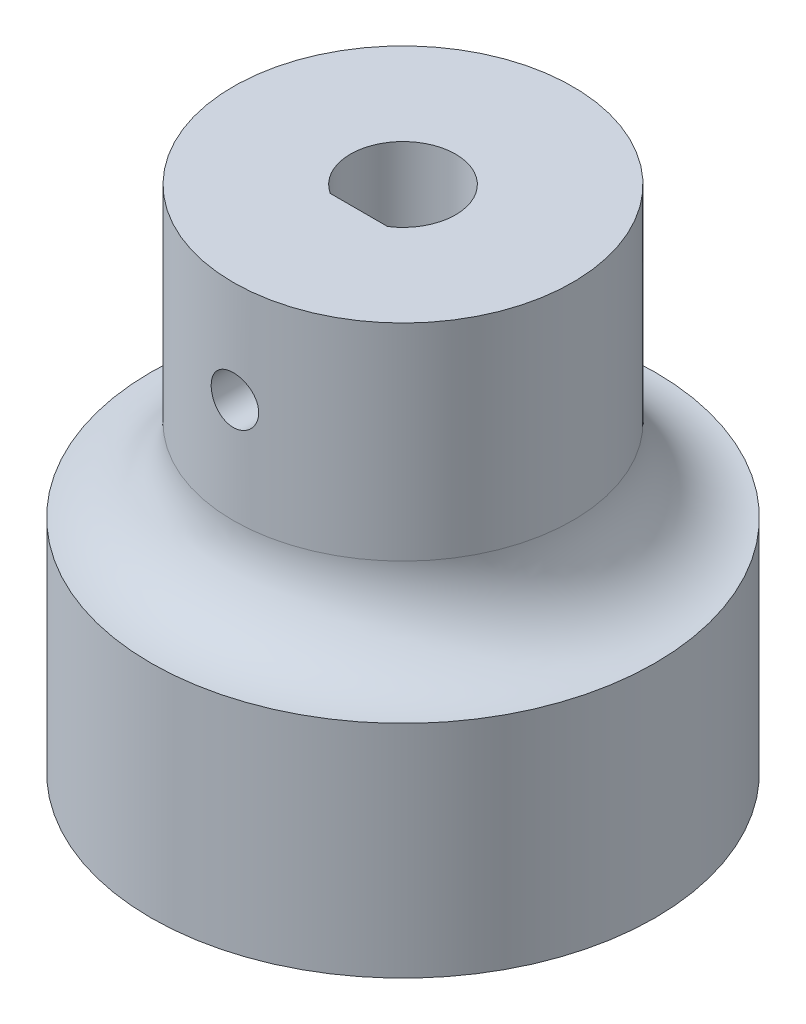
ISO-10303-21;
HEADER;
FILE_DESCRIPTION(('STEP AP214'),'2;1');
FILE_NAME('part.step','',(''),(''),'','','');
FILE_SCHEMA(('AUTOMOTIVE_DESIGN { 1 0 10303 214 1 1 1 1 }'));
ENDSEC;
DATA;
#1=APPLICATION_CONTEXT('core data for automotive mechanical design processes');
#2=APPLICATION_PROTOCOL_DEFINITION('international standard','automotive_design',2000,#1);
#3=PRODUCT_CONTEXT('',#1,'mechanical');
#4=PRODUCT('Part','Part','',(#3));
#5=PRODUCT_RELATED_PRODUCT_CATEGORY('part','',(#4));
#6=PRODUCT_DEFINITION_FORMATION('','',#4);
#7=PRODUCT_DEFINITION_CONTEXT('part definition',#1,'design');
#8=PRODUCT_DEFINITION('design','',#6,#7);
#9=PRODUCT_DEFINITION_SHAPE('','',#8);
#10=(LENGTH_UNIT() NAMED_UNIT(*) SI_UNIT(.MILLI.,.METRE.));
#11=(NAMED_UNIT(*) PLANE_ANGLE_UNIT() SI_UNIT($,.RADIAN.));
#12=(NAMED_UNIT(*) SI_UNIT($,.STERADIAN.) SOLID_ANGLE_UNIT());
#13=UNCERTAINTY_MEASURE_WITH_UNIT(LENGTH_MEASURE(1.E-05),#10,'distance_accuracy_value','');
#14=(GEOMETRIC_REPRESENTATION_CONTEXT(3) GLOBAL_UNCERTAINTY_ASSIGNED_CONTEXT((#13)) GLOBAL_UNIT_ASSIGNED_CONTEXT((#10,
#11,#12)) REPRESENTATION_CONTEXT('',''));
#15=CARTESIAN_POINT('',(0.,0.,0.));
#16=DIRECTION('',(0.,0.,1.));
#17=DIRECTION('',(1.,0.,0.));
#18=AXIS2_PLACEMENT_3D('',#15,#16,#17);
#19=CARTESIAN_POINT('',(0.,30.,0.));
#20=DIRECTION('',(0.,-1.,0.));
#21=DIRECTION('',(0.,0.,-1.));
#22=AXIS2_PLACEMENT_3D('',#19,#20,#21);
#23=CYLINDRICAL_SURFACE('',#22,10.);
#24=CARTESIAN_POINT('',(0.,17.85,0.));
#25=DIRECTION('',(0.,1.,0.));
#26=DIRECTION('',(0.,0.,1.));
#27=AXIS2_PLACEMENT_3D('',#24,#25,#26);
#28=CIRCLE('',#27,10.);
#29=CARTESIAN_POINT('',(0.,17.85,10.));
#30=VERTEX_POINT('',#29);
#31=EDGE_CURVE('E204',#30,#30,#28,.T.);
#32=ORIENTED_EDGE('',*,*,#31,.T.);
#33=EDGE_LOOP('',(#32));
#34=FACE_BOUND('',#33,.T.);
#35=CARTESIAN_POINT('',(-1.4,24.,9.90151503558925));
#36=CARTESIAN_POINT('',(-1.39999672662405,24.0782240619009,9.90151627306071));
#37=CARTESIAN_POINT('',(-1.39342177423909,24.1564950029748,9.90245203756477));
#38=CARTESIAN_POINT('',(-1.36730024696761,24.310852769077,9.90609192632171));
#39=CARTESIAN_POINT('',(-1.34774063944957,24.3869373195087,9.90879782721156));
#40=CARTESIAN_POINT('',(-1.29624278801192,24.5346654373276,9.91566563693762));
#41=CARTESIAN_POINT('',(-1.26431358038298,24.6063122024095,9.91982648268597));
#42=CARTESIAN_POINT('',(-1.18900339025604,24.7432195094394,9.92913409071497));
#43=CARTESIAN_POINT('',(-1.14562414428123,24.8084810177258,9.93428070346085));
#44=CARTESIAN_POINT('',(-1.04832112500601,24.9312328634136,9.94502019376564));
#45=CARTESIAN_POINT('',(-0.994333169772058,24.9886721047782,9.9506156584144));
#46=CARTESIAN_POINT('',(-0.877483707414621,25.093706722025,9.96159922546733));
#47=CARTESIAN_POINT('',(-0.814621732685798,25.1413015788435,9.96698731692518));
#48=CARTESIAN_POINT('',(-0.681483697113109,25.2254828738298,9.97697589409726));
#49=CARTESIAN_POINT('',(-0.611177809429794,25.2620225739707,9.98157300141576));
#50=CARTESIAN_POINT('',(-0.465351986064071,25.3227566428065,9.98943307242256));
#51=CARTESIAN_POINT('',(-0.389832291375446,25.3469515816706,9.99269609772692));
#52=CARTESIAN_POINT('',(-0.236247513331736,25.3821552954104,9.99750210964365));
#53=CARTESIAN_POINT('',(-0.158202346205083,25.3932494160138,9.99905622439133));
#54=CARTESIAN_POINT('',(-0.00134369084847479,25.4022013637562,10.0003073920407));
#55=CARTESIAN_POINT('',(0.0774697597360307,25.4000598362116,10.0000045354807));
#56=CARTESIAN_POINT('',(0.233046160023504,25.3826690685239,9.99758482232097));
#57=CARTESIAN_POINT('',(0.309819597453308,25.3675116329436,9.99548067103802));
#58=CARTESIAN_POINT('',(0.459722376120685,25.3246631665315,9.98970897409182));
#59=CARTESIAN_POINT('',(0.532851633564829,25.2969718476459,9.98604139249792));
#60=CARTESIAN_POINT('',(0.673670721318747,25.2297461572451,9.97753303441477));
#61=CARTESIAN_POINT('',(0.741341641724476,25.1901726835853,9.97268839463014));
#62=CARTESIAN_POINT('',(0.86911689514609,25.1003345312268,9.96236674208745));
#63=CARTESIAN_POINT('',(0.92922079321609,25.0500692384179,9.9568896930137));
#64=CARTESIAN_POINT('',(1.04069628788961,24.9397616926621,9.94585954014102));
#65=CARTESIAN_POINT('',(1.09198863528123,24.8796393437514,9.94030618681269));
#66=CARTESIAN_POINT('',(1.18376741736725,24.7515977294033,9.92979533265181));
#67=CARTESIAN_POINT('',(1.22425380072513,24.6836784269267,9.92483783465007));
#68=CARTESIAN_POINT('',(1.29327948111305,24.5418933484411,9.91608014267365));
#69=CARTESIAN_POINT('',(1.32181139219249,24.468023929712,9.91228066456384));
#70=CARTESIAN_POINT('',(1.36604248657344,24.3164768838692,9.90628238974169));
#71=CARTESIAN_POINT('',(1.38174245258774,24.2387994893377,9.90408349539911));
#72=CARTESIAN_POINT('',(1.39975688402148,24.0825443790757,9.90155361688983));
#73=CARTESIAN_POINT('',(1.40218334699348,24.00397981929,9.90120700434131));
#74=CARTESIAN_POINT('',(1.39387837110511,23.8475652427712,9.90237951129802));
#75=CARTESIAN_POINT('',(1.3831472862832,23.7697152068687,9.90389858060216));
#76=CARTESIAN_POINT('',(1.34892653360383,23.6172817335727,9.90861697602897));
#77=CARTESIAN_POINT('',(1.3254920021692,23.5426856738765,9.91180903893252));
#78=CARTESIAN_POINT('',(1.26658667705874,23.3984809488866,9.9195078141658));
#79=CARTESIAN_POINT('',(1.23111536021524,23.328872500534,9.92401458363684));
#80=CARTESIAN_POINT('',(1.14887163817769,23.1961149060344,9.93387205811628));
#81=CARTESIAN_POINT('',(1.10202633440552,23.1330113257238,9.93922812639451));
#82=CARTESIAN_POINT('',(0.998466461543066,23.015521684502,9.95016427300039));
#83=CARTESIAN_POINT('',(0.94175140831756,22.961136051479,9.95574436230647));
#84=CARTESIAN_POINT('',(0.819570399745713,22.8622275987041,9.96654831644374));
#85=CARTESIAN_POINT('',(0.754044282367005,22.8177787389132,9.97176932192275));
#86=CARTESIAN_POINT('',(0.616390628320449,22.7405193637223,9.98122313930672));
#87=CARTESIAN_POINT('',(0.544263252876918,22.7077085641782,9.98545597533705));
#88=CARTESIAN_POINT('',(0.395691655713114,22.6547765374091,9.99244393583438));
#89=CARTESIAN_POINT('',(0.319262421544563,22.6346139051488,9.99520387749127));
#90=CARTESIAN_POINT('',(0.164061795812,22.607416243492,9.99895521214528));
#91=CARTESIAN_POINT('',(0.0852905384378631,22.6003804634388,9.99994670627057));
#92=CARTESIAN_POINT('',(-0.0716387766005753,22.599652737662,10.0000486453509));
#93=CARTESIAN_POINT('',(-0.149796321377755,22.6058472639228,9.99917509410873));
#94=CARTESIAN_POINT('',(-0.303947255586206,22.6311621884341,9.99567716257507));
#95=CARTESIAN_POINT('',(-0.37994064946343,22.6502825601283,9.99305278588063));
#96=CARTESIAN_POINT('',(-0.527581736464291,22.7008680443135,9.98634668245479));
#97=CARTESIAN_POINT('',(-0.599231816611354,22.7323263037413,9.9822657648701));
#98=CARTESIAN_POINT('',(-0.736254303299754,22.806682671579,9.97309634224917));
#99=CARTESIAN_POINT('',(-0.801626559518838,22.8495810538294,9.96800781309465));
#100=CARTESIAN_POINT('',(-0.924815450464117,22.9460146289401,9.95733781361617));
#101=CARTESIAN_POINT('',(-0.982565906097607,22.9996339603557,9.95175265152417));
#102=CARTESIAN_POINT('',(-1.08829175391991,23.1158107732826,9.94074715508526));
#103=CARTESIAN_POINT('',(-1.1362648417956,23.1783703559205,9.93532685984937));
#104=CARTESIAN_POINT('',(-1.22127990372749,23.3110062837696,9.92523664859479));
#105=CARTESIAN_POINT('',(-1.25826763499522,23.3811176734009,9.92057050635007));
#106=CARTESIAN_POINT('',(-1.31988888235082,23.526587040073,9.91256109215702));
#107=CARTESIAN_POINT('',(-1.34453547996553,23.6019393648155,9.90921642025511));
#108=CARTESIAN_POINT('',(-1.37505100954109,23.7313772451973,9.90501810390984));
#109=CARTESIAN_POINT('',(-1.38439293421899,23.7846557420768,9.90371123781127));
#110=CARTESIAN_POINT('',(-1.39686852742366,23.8919487075781,9.9019592807621));
#111=CARTESIAN_POINT('',(-1.40000226123344,23.9459631684547,9.90151418074951));
#112=CARTESIAN_POINT('',(-1.4,24.,9.90151503558925));
#113=B_SPLINE_CURVE_WITH_KNOTS('',3,(#35,#36,#37,#38,#39,#40,#41,#42,#43,#44,#45,#46,#47,#48,
#49,#50,#51,#52,#53,#54,#55,#56,#57,#58,#59,#60,#61,#62,#63,#64,#65,#66,#67,#68,#69,#70,#71,#72,
#73,#74,#75,#76,#77,#78,#79,#80,#81,#82,#83,#84,#85,#86,#87,#88,#89,#90,#91,#92,#93,#94,#95,#96,
#97,#98,#99,#100,#101,#102,#103,#104,#105,#106,#107,#108,#109,#110,#111,#112),.UNSPECIFIED.,.T.,
.F.,(4,2,2,2,2,2,2,2,2,2,2,2,2,2,2,2,2,2,2,2,2,2,2,2,2,2,2,2,2,2,2,2,2,2,2,2,2,2,4),(0.,
0.234474721077553,0.469185139765228,0.703724419183187,0.93822814857916,1.17419689654788,
1.41017808323869,1.64714342111303,1.88409781324488,2.11949988938907,2.35489048837259,
2.5886343271484,2.82238353809807,3.05691056944184,3.2914510750476,3.52800157028831,
3.76455318930292,4.00125074460862,4.23793386094717,4.47261680490461,4.70729343423817,
4.94095956440578,5.17463585195518,5.4098513082428,5.64507830567474,5.88200177335285,
6.1189194561282,6.35505746149814,6.59118196294743,6.82528844692471,7.05939444992751,
7.29337060280254,7.5273523568313,7.76324807874158,7.99919933202215,8.2362969868904,
8.47314278481745,8.63511857506059,8.79709266201813),.UNSPECIFIED.);
#114=CARTESIAN_POINT('',(-1.4,24.,9.90151503558925));
#115=VERTEX_POINT('',#114);
#116=EDGE_CURVE('E79',#115,#115,#113,.T.);
#117=ORIENTED_EDGE('',*,*,#116,.T.);
#118=EDGE_LOOP('',(#117));
#119=FACE_BOUND('',#118,.T.);
#120=CARTESIAN_POINT('',(0.,30.,0.));
#121=DIRECTION('',(0.,1.,0.));
#122=DIRECTION('',(0.,0.,1.));
#123=AXIS2_PLACEMENT_3D('',#120,#121,#122);
#124=CIRCLE('',#123,10.);
#125=CARTESIAN_POINT('',(0.,30.,10.));
#126=VERTEX_POINT('',#125);
#127=EDGE_CURVE('E69',#126,#126,#124,.T.);
#128=ORIENTED_EDGE('',*,*,#127,.F.);
#129=EDGE_LOOP('',(#128));
#130=FACE_BOUND('',#129,.T.);
#131=ADVANCED_FACE('F38',(#34,#119,#130),#23,.T.);
#132=CARTESIAN_POINT('',(0.,30.,0.));
#133=DIRECTION('',(0.,1.,0.));
#134=DIRECTION('',(0.,0.,1.));
#135=AXIS2_PLACEMENT_3D('',#132,#133,#134);
#136=PLANE('',#135);
#137=CARTESIAN_POINT('',(0.,30.,0.));
#138=DIRECTION('',(0.,1.,0.));
#139=DIRECTION('',(0.,0.,1.));
#140=AXIS2_PLACEMENT_3D('',#137,#138,#139);
#141=CIRCLE('',#140,3.1);
#142=CARTESIAN_POINT('',(1.68819430161341,30.,2.6));
#143=VERTEX_POINT('',#142);
#144=CARTESIAN_POINT('',(-1.68819430161341,30.,2.6));
#145=VERTEX_POINT('',#144);
#146=EDGE_CURVE('E53',#143,#145,#141,.T.);
#147=ORIENTED_EDGE('',*,*,#146,.F.);
#148=DIRECTION('',(1.,0.,0.));
#149=VECTOR('',#148,1.);
#150=CARTESIAN_POINT('',(-1.68819430161341,30.,2.6));
#151=LINE('',#150,#149);
#152=EDGE_CURVE('E73',#145,#143,#151,.T.);
#153=ORIENTED_EDGE('',*,*,#152,.F.);
#154=EDGE_LOOP('',(#147,#153));
#155=FACE_BOUND('',#154,.T.);
#156=ORIENTED_EDGE('',*,*,#127,.T.);
#157=EDGE_LOOP('',(#156));
#158=FACE_BOUND('',#157,.T.);
#159=ADVANCED_FACE('F77',(#155,#158),#136,.T.);
#160=CARTESIAN_POINT('',(0.,18.,0.));
#161=DIRECTION('',(0.,1.,0.));
#162=DIRECTION('',(0.,0.,1.));
#163=AXIS2_PLACEMENT_3D('',#160,#161,#162);
#164=CYLINDRICAL_SURFACE('',#163,3.1);
#165=ORIENTED_EDGE('',*,*,#146,.T.);
#166=DIRECTION('',(0.,1.,0.));
#167=VECTOR('',#166,1.);
#168=CARTESIAN_POINT('',(-1.68819430161341,18.,2.6));
#169=LINE('',#168,#167);
#170=CARTESIAN_POINT('',(-1.68819430161341,18.,2.6));
#171=VERTEX_POINT('',#170);
#172=EDGE_CURVE('E70',#171,#145,#169,.T.);
#173=ORIENTED_EDGE('',*,*,#172,.F.);
#174=CARTESIAN_POINT('',(0.,18.,0.));
#175=DIRECTION('',(0.,1.,0.));
#176=DIRECTION('',(0.,0.,1.));
#177=AXIS2_PLACEMENT_3D('',#174,#175,#176);
#178=CIRCLE('',#177,3.1);
#179=CARTESIAN_POINT('',(1.68819430161341,18.,2.6));
#180=VERTEX_POINT('',#179);
#181=EDGE_CURVE('E67',#180,#171,#178,.T.);
#182=ORIENTED_EDGE('',*,*,#181,.F.);
#183=DIRECTION('',(0.,1.,0.));
#184=VECTOR('',#183,1.);
#185=CARTESIAN_POINT('',(1.68819430161341,18.,2.6));
#186=LINE('',#185,#184);
#187=EDGE_CURVE('E61',#180,#143,#186,.T.);
#188=ORIENTED_EDGE('',*,*,#187,.T.);
#189=EDGE_LOOP('',(#165,#173,#182,#188));
#190=FACE_BOUND('',#189,.T.);
#191=ADVANCED_FACE('F65',(#190),#164,.F.);
#192=CARTESIAN_POINT('',(-1.68819430161341,18.,2.6));
#193=DIRECTION('',(0.,0.,1.));
#194=DIRECTION('',(1.,0.,0.));
#195=AXIS2_PLACEMENT_3D('',#192,#193,#194);
#196=PLANE('',#195);
#197=CARTESIAN_POINT('',(0.,24.,2.6));
#198=DIRECTION('',(0.,0.,-1.));
#199=DIRECTION('',(-1.,0.,0.));
#200=AXIS2_PLACEMENT_3D('',#197,#198,#199);
#201=CIRCLE('',#200,1.4);
#202=CARTESIAN_POINT('',(-1.4,24.,2.6));
#203=VERTEX_POINT('',#202);
#204=EDGE_CURVE('E82',#203,#203,#201,.T.);
#205=ORIENTED_EDGE('',*,*,#204,.F.);
#206=EDGE_LOOP('',(#205));
#207=FACE_BOUND('',#206,.T.);
#208=ORIENTED_EDGE('',*,*,#152,.T.);
#209=ORIENTED_EDGE('',*,*,#187,.F.);
#210=DIRECTION('',(1.,0.,0.));
#211=VECTOR('',#210,1.);
#212=CARTESIAN_POINT('',(-1.68819430161341,18.,2.6));
#213=LINE('',#212,#211);
#214=EDGE_CURVE('E85',#171,#180,#213,.T.);
#215=ORIENTED_EDGE('',*,*,#214,.F.);
#216=ORIENTED_EDGE('',*,*,#172,.T.);
#217=EDGE_LOOP('',(#208,#209,#215,#216));
#218=FACE_BOUND('',#217,.T.);
#219=ADVANCED_FACE('F74',(#207,#218),#196,.F.);
#220=CARTESIAN_POINT('',(0.,18.,0.));
#221=DIRECTION('',(0.,1.,0.));
#222=DIRECTION('',(0.,0.,1.));
#223=AXIS2_PLACEMENT_3D('',#220,#221,#222);
#224=PLANE('',#223);
#225=ORIENTED_EDGE('',*,*,#181,.T.);
#226=ORIENTED_EDGE('',*,*,#214,.T.);
#227=EDGE_LOOP('',(#225,#226));
#228=FACE_BOUND('',#227,.T.);
#229=ADVANCED_FACE('F126',(#228),#224,.T.);
#230=CARTESIAN_POINT('',(0.,24.,14.85));
#231=DIRECTION('',(0.,0.,-1.));
#232=DIRECTION('',(-1.,0.,0.));
#233=AXIS2_PLACEMENT_3D('',#230,#231,#232);
#234=CYLINDRICAL_SURFACE('',#233,1.4);
#235=ORIENTED_EDGE('',*,*,#204,.T.);
#236=EDGE_LOOP('',(#235));
#237=FACE_BOUND('',#236,.T.);
#238=ORIENTED_EDGE('',*,*,#116,.F.);
#239=EDGE_LOOP('',(#238));
#240=FACE_BOUND('',#239,.T.);
#241=ADVANCED_FACE('F103',(#237,#240),#234,.F.);
#242=CARTESIAN_POINT('',(0.,17.85,0.));
#243=DIRECTION('',(0.,1.,0.));
#244=DIRECTION('',(0.,0.,1.));
#245=AXIS2_PLACEMENT_3D('',#242,#243,#244);
#246=TOROIDAL_SURFACE('',#245,14.85,4.85000000000001);
#247=ORIENTED_EDGE('',*,*,#31,.F.);
#248=EDGE_LOOP('',(#247));
#249=FACE_BOUND('',#248,.T.);
#250=CARTESIAN_POINT('',(0.,13.,0.));
#251=DIRECTION('',(0.,1.,0.));
#252=DIRECTION('',(0.,0.,1.));
#253=AXIS2_PLACEMENT_3D('',#250,#251,#252);
#254=CIRCLE('',#253,14.85);
#255=CARTESIAN_POINT('',(0.,13.,14.85));
#256=VERTEX_POINT('',#255);
#257=EDGE_CURVE('E11',#256,#256,#254,.T.);
#258=ORIENTED_EDGE('',*,*,#257,.T.);
#259=EDGE_LOOP('',(#258));
#260=FACE_BOUND('',#259,.T.);
#261=ADVANCED_FACE('F97',(#249,#260),#246,.F.);
#262=CARTESIAN_POINT('',(0.,0.,0.));
#263=DIRECTION('',(0.,1.,0.));
#264=DIRECTION('',(0.,0.,1.));
#265=AXIS2_PLACEMENT_3D('',#262,#263,#264);
#266=PLANE('',#265);
#267=CARTESIAN_POINT('',(0.,0.,0.));
#268=DIRECTION('',(0.,1.,0.));
#269=DIRECTION('',(0.,0.,1.));
#270=AXIS2_PLACEMENT_3D('',#267,#268,#269);
#271=CIRCLE('',#270,14.85);
#272=CARTESIAN_POINT('',(0.,0.,14.85));
#273=VERTEX_POINT('',#272);
#274=EDGE_CURVE('E42',#273,#273,#271,.T.);
#275=ORIENTED_EDGE('',*,*,#274,.F.);
#276=EDGE_LOOP('',(#275));
#277=FACE_BOUND('',#276,.T.);
#278=ADVANCED_FACE('F95',(#277),#266,.F.);
#279=CARTESIAN_POINT('',(0.,13.,0.));
#280=DIRECTION('',(0.,-1.,0.));
#281=DIRECTION('',(0.,0.,-1.));
#282=AXIS2_PLACEMENT_3D('',#279,#280,#281);
#283=CYLINDRICAL_SURFACE('',#282,14.85);
#284=ORIENTED_EDGE('',*,*,#257,.F.);
#285=EDGE_LOOP('',(#284));
#286=FACE_BOUND('',#285,.T.);
#287=ORIENTED_EDGE('',*,*,#274,.T.);
#288=EDGE_LOOP('',(#287));
#289=FACE_BOUND('',#288,.T.);
#290=ADVANCED_FACE('F40',(#286,#289),#283,.T.);
#291=CLOSED_SHELL('',(#131,#159,#191,#219,#229,#241,#261,#278,#290));
#292=MANIFOLD_SOLID_BREP('B2',#291);
#293=ADVANCED_BREP_SHAPE_REPRESENTATION('',(#18,#292),#14);
#294=SHAPE_DEFINITION_REPRESENTATION(#9,#293);
ENDSEC;
END-ISO-10303-21;
